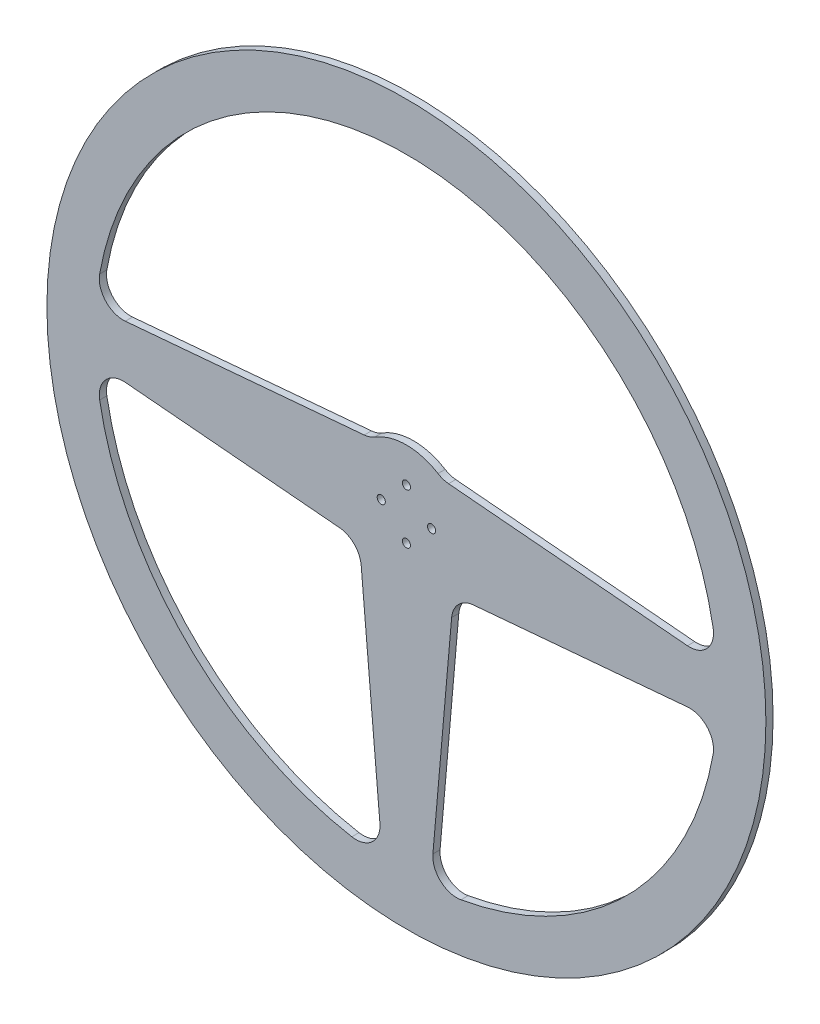
ISO-10303-21;
HEADER;
FILE_DESCRIPTION(('STEP AP214'),'2;1');
FILE_NAME('part.step','',(''),(''),'','','');
FILE_SCHEMA(('AUTOMOTIVE_DESIGN { 1 0 10303 214 1 1 1 1 }'));
ENDSEC;
DATA;
#1=APPLICATION_CONTEXT('core data for automotive mechanical design processes');
#2=APPLICATION_PROTOCOL_DEFINITION('international standard','automotive_design',2000,#1);
#3=PRODUCT_CONTEXT('',#1,'mechanical');
#4=PRODUCT('Part','Part','',(#3));
#5=PRODUCT_RELATED_PRODUCT_CATEGORY('part','',(#4));
#6=PRODUCT_DEFINITION_FORMATION('','',#4);
#7=PRODUCT_DEFINITION_CONTEXT('part definition',#1,'design');
#8=PRODUCT_DEFINITION('design','',#6,#7);
#9=PRODUCT_DEFINITION_SHAPE('','',#8);
#10=(LENGTH_UNIT() NAMED_UNIT(*) SI_UNIT(.MILLI.,.METRE.));
#11=(NAMED_UNIT(*) PLANE_ANGLE_UNIT() SI_UNIT($,.RADIAN.));
#12=(NAMED_UNIT(*) SI_UNIT($,.STERADIAN.) SOLID_ANGLE_UNIT());
#13=UNCERTAINTY_MEASURE_WITH_UNIT(LENGTH_MEASURE(1.E-05),#10,'distance_accuracy_value','');
#14=(GEOMETRIC_REPRESENTATION_CONTEXT(3) GLOBAL_UNCERTAINTY_ASSIGNED_CONTEXT((#13)) GLOBAL_UNIT_ASSIGNED_CONTEXT((#10,
#11,#12)) REPRESENTATION_CONTEXT('',''));
#15=CARTESIAN_POINT('',(0.,0.,0.));
#16=DIRECTION('',(0.,0.,1.));
#17=DIRECTION('',(1.,0.,0.));
#18=AXIS2_PLACEMENT_3D('',#15,#16,#17);
#19=CARTESIAN_POINT('',(0.,0.,3.));
#20=DIRECTION('',(0.,0.,-1.));
#21=DIRECTION('',(-1.,0.,0.));
#22=AXIS2_PLACEMENT_3D('',#19,#20,#21);
#23=CYLINDRICAL_SURFACE('',#22,130.);
#24=CARTESIAN_POINT('',(0.,0.,0.));
#25=DIRECTION('',(0.,0.,1.));
#26=DIRECTION('',(1.,0.,0.));
#27=AXIS2_PLACEMENT_3D('',#24,#25,#26);
#28=CIRCLE('',#27,130.);
#29=CARTESIAN_POINT('',(127.991176755483,22.7652953582125,0.));
#30=VERTEX_POINT('',#29);
#31=CARTESIAN_POINT('',(-127.991176755479,22.7652953582353,0.));
#32=VERTEX_POINT('',#31);
#33=EDGE_CURVE('E204',#30,#32,#28,.T.);
#34=ORIENTED_EDGE('',*,*,#33,.F.);
#35=DIRECTION('',(0.,0.,-1.));
#36=VECTOR('',#35,1.);
#37=CARTESIAN_POINT('',(127.991176755483,22.7652953582125,3.));
#38=LINE('',#37,#36);
#39=CARTESIAN_POINT('',(127.991176755483,22.7652953582125,3.));
#40=VERTEX_POINT('',#39);
#41=EDGE_CURVE('E57',#30,#40,#38,.F.);
#42=ORIENTED_EDGE('',*,*,#41,.T.);
#43=CARTESIAN_POINT('',(0.,0.,3.));
#44=DIRECTION('',(0.,0.,1.));
#45=DIRECTION('',(1.,0.,0.));
#46=AXIS2_PLACEMENT_3D('',#43,#44,#45);
#47=CIRCLE('',#46,130.);
#48=CARTESIAN_POINT('',(-127.991176755479,22.7652953582353,3.));
#49=VERTEX_POINT('',#48);
#50=EDGE_CURVE('E307',#40,#49,#47,.T.);
#51=ORIENTED_EDGE('',*,*,#50,.T.);
#52=DIRECTION('',(0.,0.,-1.));
#53=VECTOR('',#52,1.);
#54=CARTESIAN_POINT('',(-127.991176755479,22.7652953582353,3.));
#55=LINE('',#54,#53);
#56=EDGE_CURVE('E262',#49,#32,#55,.T.);
#57=ORIENTED_EDGE('',*,*,#56,.T.);
#58=EDGE_LOOP('',(#34,#42,#51,#57));
#59=FACE_BOUND('',#58,.T.);
#60=ADVANCED_FACE('F37',(#59),#23,.F.);
#61=CARTESIAN_POINT('',(1.85042362908211,21.1504388626259,3.));
#62=DIRECTION('',(0.0871557427478548,0.996194698091728,0.));
#63=DIRECTION('',(-0.996194698091728,0.0871557427478548,0.));
#64=AXIS2_PLACEMENT_3D('',#61,#62,#63);
#65=PLANE('',#64);
#66=DIRECTION('',(0.996194698091728,-0.0871557427478548,0.));
#67=VECTOR('',#66,1.);
#68=CARTESIAN_POINT('',(1.85042362908211,21.1504388626259,0.));
#69=LINE('',#68,#67);
#70=CARTESIAN_POINT('',(17.5893624701358,19.7734601381027,0.));
#71=VERTEX_POINT('',#70);
#72=CARTESIAN_POINT('',(117.274144192968,11.0521718112789,0.));
#73=VERTEX_POINT('',#72);
#74=EDGE_CURVE('E209',#71,#73,#69,.T.);
#75=ORIENTED_EDGE('',*,*,#74,.F.);
#76=DIRECTION('',(0.,0.,-1.));
#77=VECTOR('',#76,1.);
#78=CARTESIAN_POINT('',(17.5893624701358,19.7734601381027,3.));
#79=LINE('',#78,#77);
#80=CARTESIAN_POINT('',(17.5893624701358,19.7734601381027,3.));
#81=VERTEX_POINT('',#80);
#82=EDGE_CURVE('E245',#71,#81,#79,.F.);
#83=ORIENTED_EDGE('',*,*,#82,.T.);
#84=DIRECTION('',(0.996194698091728,-0.0871557427478548,0.));
#85=VECTOR('',#84,1.);
#86=CARTESIAN_POINT('',(1.85042362908211,21.1504388626259,3.));
#87=LINE('',#86,#85);
#88=CARTESIAN_POINT('',(117.274144192968,11.0521718112789,3.));
#89=VERTEX_POINT('',#88);
#90=EDGE_CURVE('E309',#81,#89,#87,.T.);
#91=ORIENTED_EDGE('',*,*,#90,.T.);
#92=DIRECTION('',(0.,0.,1.));
#93=VECTOR('',#92,1.);
#94=CARTESIAN_POINT('',(117.274144192968,11.0521718112789,0.));
#95=LINE('',#94,#93);
#96=EDGE_CURVE('E242',#89,#73,#95,.F.);
#97=ORIENTED_EDGE('',*,*,#96,.T.);
#98=EDGE_LOOP('',(#75,#83,#91,#97));
#99=FACE_BOUND('',#98,.T.);
#100=ADVANCED_FACE('F425',(#99),#65,.T.);
#101=CARTESIAN_POINT('',(0.,0.,3.));
#102=DIRECTION('',(0.,0.,-1.));
#103=DIRECTION('',(-1.,0.,0.));
#104=AXIS2_PLACEMENT_3D('',#101,#102,#103);
#105=CYLINDRICAL_SURFACE('',#104,25.);
#106=CARTESIAN_POINT('',(0.,0.,3.));
#107=DIRECTION('',(0.,0.,1.));
#108=DIRECTION('',(1.,0.,0.));
#109=AXIS2_PLACEMENT_3D('',#106,#107,#108);
#110=CIRCLE('',#109,25.);
#111=CARTESIAN_POINT('',(13.1863713554388,21.2395765135857,3.));
#112=VERTEX_POINT('',#111);
#113=CARTESIAN_POINT('',(-13.1863713554376,21.2395765135865,3.));
#114=VERTEX_POINT('',#113);
#115=EDGE_CURVE('E314',#112,#114,#110,.T.);
#116=ORIENTED_EDGE('',*,*,#115,.F.);
#117=DIRECTION('',(0.,0.,-1.));
#118=VECTOR('',#117,1.);
#119=CARTESIAN_POINT('',(13.1863713554388,21.2395765135857,3.));
#120=LINE('',#119,#118);
#121=CARTESIAN_POINT('',(13.1863713554388,21.2395765135857,0.));
#122=VERTEX_POINT('',#121);
#123=EDGE_CURVE('E239',#112,#122,#120,.T.);
#124=ORIENTED_EDGE('',*,*,#123,.T.);
#125=CARTESIAN_POINT('',(0.,0.,0.));
#126=DIRECTION('',(0.,0.,1.));
#127=DIRECTION('',(1.,0.,0.));
#128=AXIS2_PLACEMENT_3D('',#125,#126,#127);
#129=CIRCLE('',#128,25.);
#130=CARTESIAN_POINT('',(-13.1863713554376,21.2395765135865,0.));
#131=VERTEX_POINT('',#130);
#132=EDGE_CURVE('E212',#122,#131,#129,.T.);
#133=ORIENTED_EDGE('',*,*,#132,.T.);
#134=DIRECTION('',(0.,0.,-1.));
#135=VECTOR('',#134,1.);
#136=CARTESIAN_POINT('',(-13.1863713554376,21.2395765135865,3.));
#137=LINE('',#136,#135);
#138=EDGE_CURVE('E237',#131,#114,#137,.F.);
#139=ORIENTED_EDGE('',*,*,#138,.T.);
#140=EDGE_LOOP('',(#116,#124,#133,#139));
#141=FACE_BOUND('',#140,.T.);
#142=ADVANCED_FACE('F431',(#141),#105,.T.);
#143=CARTESIAN_POINT('',(21.1504388626266,-1.85042362908007,3.));
#144=DIRECTION('',(0.996194698091737,-0.0871557427477565,0.));
#145=DIRECTION('',(0.0871557427477565,0.996194698091737,0.));
#146=AXIS2_PLACEMENT_3D('',#143,#144,#145);
#147=PLANE('',#146);
#148=DIRECTION('',(-0.0871557427477565,-0.996194698091737,0.));
#149=VECTOR('',#148,1.);
#150=CARTESIAN_POINT('',(21.1504388626266,-1.85042362908007,0.));
#151=LINE('',#150,#149);
#152=CARTESIAN_POINT('',(18.8664255619977,-27.9568151154413,0.));
#153=VERTEX_POINT('',#152);
#154=CARTESIAN_POINT('',(11.052171811291,-117.274144192966,0.));
#155=VERTEX_POINT('',#154);
#156=EDGE_CURVE('E202',#153,#155,#151,.T.);
#157=ORIENTED_EDGE('',*,*,#156,.F.);
#158=DIRECTION('',(0.,0.,-1.));
#159=VECTOR('',#158,1.);
#160=CARTESIAN_POINT('',(18.8664255619977,-27.9568151154413,3.));
#161=LINE('',#160,#159);
#162=CARTESIAN_POINT('',(18.8664255619977,-27.9568151154413,3.));
#163=VERTEX_POINT('',#162);
#164=EDGE_CURVE('E179',#153,#163,#161,.F.);
#165=ORIENTED_EDGE('',*,*,#164,.T.);
#166=DIRECTION('',(-0.0871557427477565,-0.996194698091737,0.));
#167=VECTOR('',#166,1.);
#168=CARTESIAN_POINT('',(21.1504388626266,-1.85042362908007,3.));
#169=LINE('',#168,#167);
#170=CARTESIAN_POINT('',(11.052171811291,-117.274144192966,3.));
#171=VERTEX_POINT('',#170);
#172=EDGE_CURVE('E320',#163,#171,#169,.T.);
#173=ORIENTED_EDGE('',*,*,#172,.T.);
#174=DIRECTION('',(0.,0.,1.));
#175=VECTOR('',#174,1.);
#176=CARTESIAN_POINT('',(11.052171811291,-117.274144192966,0.));
#177=LINE('',#176,#175);
#178=EDGE_CURVE('E194',#171,#155,#177,.F.);
#179=ORIENTED_EDGE('',*,*,#178,.T.);
#180=EDGE_LOOP('',(#157,#165,#173,#179));
#181=FACE_BOUND('',#180,.T.);
#182=ADVANCED_FACE('F449',(#181),#147,.T.);
#183=CARTESIAN_POINT('',(1.85042362907343,-21.1504388626228,3.));
#184=DIRECTION('',(-0.0871557427474617,0.996194698091763,0.));
#185=DIRECTION('',(-0.996194698091763,-0.0871557427474617,0.));
#186=AXIS2_PLACEMENT_3D('',#183,#184,#185);
#187=PLANE('',#186);
#188=DIRECTION('',(0.996194698091763,0.0871557427474617,0.));
#189=VECTOR('',#188,1.);
#190=CARTESIAN_POINT('',(1.85042362907343,-21.1504388626228,3.));
#191=LINE('',#190,#189);
#192=CARTESIAN_POINT('',(27.9568151154405,-18.8664255620012,3.));
#193=VERTEX_POINT('',#192);
#194=CARTESIAN_POINT('',(117.274144192964,-11.0521718113213,3.));
#195=VERTEX_POINT('',#194);
#196=EDGE_CURVE('E193',#193,#195,#191,.T.);
#197=ORIENTED_EDGE('',*,*,#196,.F.);
#198=DIRECTION('',(0.,0.,-1.));
#199=VECTOR('',#198,1.);
#200=CARTESIAN_POINT('',(27.9568151154405,-18.8664255620012,3.));
#201=LINE('',#200,#199);
#202=CARTESIAN_POINT('',(27.9568151154405,-18.8664255620012,0.));
#203=VERTEX_POINT('',#202);
#204=EDGE_CURVE('E178',#193,#203,#201,.T.);
#205=ORIENTED_EDGE('',*,*,#204,.T.);
#206=DIRECTION('',(0.996194698091763,0.0871557427474617,0.));
#207=VECTOR('',#206,1.);
#208=CARTESIAN_POINT('',(1.85042362907343,-21.1504388626228,0.));
#209=LINE('',#208,#207);
#210=CARTESIAN_POINT('',(117.274144192964,-11.0521718113213,0.));
#211=VERTEX_POINT('',#210);
#212=EDGE_CURVE('E190',#203,#211,#209,.T.);
#213=ORIENTED_EDGE('',*,*,#212,.T.);
#214=DIRECTION('',(0.,0.,-1.));
#215=VECTOR('',#214,1.);
#216=CARTESIAN_POINT('',(117.274144192964,-11.0521718113213,3.));
#217=LINE('',#216,#215);
#218=EDGE_CURVE('E195',#211,#195,#217,.F.);
#219=ORIENTED_EDGE('',*,*,#218,.T.);
#220=EDGE_LOOP('',(#197,#205,#213,#219));
#221=FACE_BOUND('',#220,.T.);
#222=ADVANCED_FACE('F189',(#221),#187,.F.);
#223=CARTESIAN_POINT('',(-1.85042362907774,-21.1504388626241,3.));
#224=DIRECTION('',(-0.0871557427476582,-0.996194698091746,0.));
#225=DIRECTION('',(0.996194698091746,-0.0871557427476582,0.));
#226=AXIS2_PLACEMENT_3D('',#223,#224,#225);
#227=PLANE('',#226);
#228=DIRECTION('',(-0.996194698091746,0.0871557427476583,0.));
#229=VECTOR('',#228,1.);
#230=CARTESIAN_POINT('',(-1.85042362907774,-21.1504388626241,0.));
#231=LINE('',#230,#229);
#232=CARTESIAN_POINT('',(-27.9568151154386,-18.8664255619978,0.));
#233=VERTEX_POINT('',#232);
#234=CARTESIAN_POINT('',(-117.274144192966,-11.0521718112998,0.));
#235=VERTEX_POINT('',#234);
#236=EDGE_CURVE('E336',#233,#235,#231,.T.);
#237=ORIENTED_EDGE('',*,*,#236,.F.);
#238=DIRECTION('',(0.,0.,-1.));
#239=VECTOR('',#238,1.);
#240=CARTESIAN_POINT('',(-27.9568151154386,-18.8664255619978,3.));
#241=LINE('',#240,#239);
#242=CARTESIAN_POINT('',(-27.9568151154386,-18.8664255619978,3.));
#243=VERTEX_POINT('',#242);
#244=EDGE_CURVE('E235',#233,#243,#241,.F.);
#245=ORIENTED_EDGE('',*,*,#244,.T.);
#246=DIRECTION('',(-0.996194698091746,0.0871557427476583,0.));
#247=VECTOR('',#246,1.);
#248=CARTESIAN_POINT('',(-1.85042362907774,-21.1504388626241,3.));
#249=LINE('',#248,#247);
#250=CARTESIAN_POINT('',(-117.274144192966,-11.0521718112998,3.));
#251=VERTEX_POINT('',#250);
#252=EDGE_CURVE('E221',#243,#251,#249,.T.);
#253=ORIENTED_EDGE('',*,*,#252,.T.);
#254=DIRECTION('',(0.,0.,1.));
#255=VECTOR('',#254,1.);
#256=CARTESIAN_POINT('',(-117.274144192966,-11.0521718112998,0.));
#257=LINE('',#256,#255);
#258=EDGE_CURVE('E232',#251,#235,#257,.F.);
#259=ORIENTED_EDGE('',*,*,#258,.T.);
#260=EDGE_LOOP('',(#237,#245,#253,#259));
#261=FACE_BOUND('',#260,.T.);
#262=ADVANCED_FACE('F400',(#261),#227,.T.);
#263=CARTESIAN_POINT('',(-21.1504388626216,-1.85042362907543,3.));
#264=DIRECTION('',(0.996194698091754,0.08715574274756,0.));
#265=DIRECTION('',(-0.08715574274756,0.996194698091754,0.));
#266=AXIS2_PLACEMENT_3D('',#263,#264,#265);
#267=PLANE('',#266);
#268=DIRECTION('',(0.08715574274756,-0.996194698091754,0.));
#269=VECTOR('',#268,1.);
#270=CARTESIAN_POINT('',(-21.1504388626216,-1.85042362907543,3.));
#271=LINE('',#270,#269);
#272=CARTESIAN_POINT('',(-18.8664255619977,-27.9568151154396,3.));
#273=VERTEX_POINT('',#272);
#274=CARTESIAN_POINT('',(-11.0521718113087,-117.274144192965,3.));
#275=VERTEX_POINT('',#274);
#276=EDGE_CURVE('E321',#273,#275,#271,.T.);
#277=ORIENTED_EDGE('',*,*,#276,.F.);
#278=DIRECTION('',(0.,0.,-1.));
#279=VECTOR('',#278,1.);
#280=CARTESIAN_POINT('',(-18.8664255619977,-27.9568151154396,3.));
#281=LINE('',#280,#279);
#282=CARTESIAN_POINT('',(-18.8664255619977,-27.9568151154396,0.));
#283=VERTEX_POINT('',#282);
#284=EDGE_CURVE('E229',#273,#283,#281,.T.);
#285=ORIENTED_EDGE('',*,*,#284,.T.);
#286=DIRECTION('',(0.08715574274756,-0.996194698091754,0.));
#287=VECTOR('',#286,1.);
#288=CARTESIAN_POINT('',(-21.1504388626216,-1.85042362907543,0.));
#289=LINE('',#288,#287);
#290=CARTESIAN_POINT('',(-11.0521718113087,-117.274144192965,0.));
#291=VERTEX_POINT('',#290);
#292=EDGE_CURVE('E386',#283,#291,#289,.T.);
#293=ORIENTED_EDGE('',*,*,#292,.T.);
#294=DIRECTION('',(0.,0.,-1.));
#295=VECTOR('',#294,1.);
#296=CARTESIAN_POINT('',(-11.0521718113087,-117.274144192965,3.));
#297=LINE('',#296,#295);
#298=EDGE_CURVE('E227',#291,#275,#297,.F.);
#299=ORIENTED_EDGE('',*,*,#298,.T.);
#300=EDGE_LOOP('',(#277,#285,#293,#299));
#301=FACE_BOUND('',#300,.T.);
#302=ADVANCED_FACE('F406',(#301),#267,.F.);
#303=CARTESIAN_POINT('',(-1.85042362907774,21.1504388626241,3.));
#304=DIRECTION('',(0.0871557427476582,-0.996194698091746,0.));
#305=DIRECTION('',(0.996194698091746,0.0871557427476582,0.));
#306=AXIS2_PLACEMENT_3D('',#303,#304,#305);
#307=PLANE('',#306);
#308=DIRECTION('',(-0.996194698091746,-0.0871557427476583,0.));
#309=VECTOR('',#308,1.);
#310=CARTESIAN_POINT('',(-1.85042362907774,21.1504388626241,3.));
#311=LINE('',#310,#309);
#312=CARTESIAN_POINT('',(-17.5893624701361,19.7734601381036,3.));
#313=VERTEX_POINT('',#312);
#314=CARTESIAN_POINT('',(-117.274144192966,11.0521718112998,3.));
#315=VERTEX_POINT('',#314);
#316=EDGE_CURVE('E379',#313,#315,#311,.T.);
#317=ORIENTED_EDGE('',*,*,#316,.F.);
#318=DIRECTION('',(0.,0.,1.));
#319=VECTOR('',#318,1.);
#320=CARTESIAN_POINT('',(-17.5893624701361,19.7734601381036,0.));
#321=LINE('',#320,#319);
#322=CARTESIAN_POINT('',(-17.5893624701361,19.7734601381036,0.));
#323=VERTEX_POINT('',#322);
#324=EDGE_CURVE('E249',#313,#323,#321,.F.);
#325=ORIENTED_EDGE('',*,*,#324,.T.);
#326=DIRECTION('',(-0.996194698091746,-0.0871557427476583,0.));
#327=VECTOR('',#326,1.);
#328=CARTESIAN_POINT('',(-1.85042362907774,21.1504388626241,0.));
#329=LINE('',#328,#327);
#330=CARTESIAN_POINT('',(-117.274144192966,11.0521718112998,0.));
#331=VERTEX_POINT('',#330);
#332=EDGE_CURVE('E215',#323,#331,#329,.T.);
#333=ORIENTED_EDGE('',*,*,#332,.T.);
#334=DIRECTION('',(0.,0.,-1.));
#335=VECTOR('',#334,1.);
#336=CARTESIAN_POINT('',(-117.274144192966,11.0521718112998,3.));
#337=LINE('',#336,#335);
#338=EDGE_CURVE('E247',#331,#315,#337,.F.);
#339=ORIENTED_EDGE('',*,*,#338,.T.);
#340=EDGE_LOOP('',(#317,#325,#333,#339));
#341=FACE_BOUND('',#340,.T.);
#342=ADVANCED_FACE('F305',(#341),#307,.F.);
#343=CARTESIAN_POINT('',(22.7652953582258,-127.991176755481,0.));
#344=VERTEX_POINT('',#343);
#345=CARTESIAN_POINT('',(127.991176755475,-22.7652953582588,0.));
#346=VERTEX_POINT('',#345);
#347=EDGE_CURVE('E201',#344,#346,#28,.T.);
#348=ORIENTED_EDGE('',*,*,#347,.F.);
#349=DIRECTION('',(0.,0.,-1.));
#350=VECTOR('',#349,1.);
#351=CARTESIAN_POINT('',(22.7652953582258,-127.991176755481,3.));
#352=LINE('',#351,#350);
#353=CARTESIAN_POINT('',(22.7652953582258,-127.991176755481,3.));
#354=VERTEX_POINT('',#353);
#355=EDGE_CURVE('E260',#344,#354,#352,.F.);
#356=ORIENTED_EDGE('',*,*,#355,.T.);
#357=CARTESIAN_POINT('',(127.991176755475,-22.7652953582588,3.));
#358=VERTEX_POINT('',#357);
#359=EDGE_CURVE('E310',#354,#358,#47,.T.);
#360=ORIENTED_EDGE('',*,*,#359,.T.);
#361=DIRECTION('',(0.,0.,-1.));
#362=VECTOR('',#361,1.);
#363=CARTESIAN_POINT('',(127.991176755475,-22.7652953582588,3.));
#364=LINE('',#363,#362);
#365=EDGE_CURVE('E257',#358,#346,#364,.T.);
#366=ORIENTED_EDGE('',*,*,#365,.T.);
#367=EDGE_LOOP('',(#348,#356,#360,#366));
#368=FACE_BOUND('',#367,.T.);
#369=ADVANCED_FACE('F427',(#368),#23,.F.);
#370=CARTESIAN_POINT('',(-127.991176755479,-22.7652953582353,3.));
#371=VERTEX_POINT('',#370);
#372=CARTESIAN_POINT('',(-22.7652953582451,-127.991176755477,3.));
#373=VERTEX_POINT('',#372);
#374=EDGE_CURVE('E312',#371,#373,#47,.T.);
#375=ORIENTED_EDGE('',*,*,#374,.T.);
#376=DIRECTION('',(0.,0.,-1.));
#377=VECTOR('',#376,1.);
#378=CARTESIAN_POINT('',(-22.7652953582451,-127.991176755477,3.));
#379=LINE('',#378,#377);
#380=CARTESIAN_POINT('',(-22.7652953582451,-127.991176755477,0.));
#381=VERTEX_POINT('',#380);
#382=EDGE_CURVE('E254',#373,#381,#379,.T.);
#383=ORIENTED_EDGE('',*,*,#382,.T.);
#384=CARTESIAN_POINT('',(-127.991176755479,-22.7652953582353,0.));
#385=VERTEX_POINT('',#384);
#386=EDGE_CURVE('E206',#385,#381,#28,.T.);
#387=ORIENTED_EDGE('',*,*,#386,.F.);
#388=DIRECTION('',(0.,0.,-1.));
#389=VECTOR('',#388,1.);
#390=CARTESIAN_POINT('',(-127.991176755479,-22.7652953582353,3.));
#391=LINE('',#390,#389);
#392=EDGE_CURVE('E252',#385,#371,#391,.F.);
#393=ORIENTED_EDGE('',*,*,#392,.T.);
#394=EDGE_LOOP('',(#375,#383,#387,#393));
#395=FACE_BOUND('',#394,.T.);
#396=ADVANCED_FACE('F393',(#395),#23,.F.);
#397=CARTESIAN_POINT('',(0.,0.,3.));
#398=DIRECTION('',(0.,0.,-1.));
#399=DIRECTION('',(-1.,0.,0.));
#400=AXIS2_PLACEMENT_3D('',#397,#398,#399);
#401=CYLINDRICAL_SURFACE('',#400,150.);
#402=CARTESIAN_POINT('',(0.,0.,3.));
#403=DIRECTION('',(0.,0.,1.));
#404=DIRECTION('',(1.,0.,0.));
#405=AXIS2_PLACEMENT_3D('',#402,#403,#404);
#406=CIRCLE('',#405,150.);
#407=CARTESIAN_POINT('',(150.,0.,3.));
#408=VERTEX_POINT('',#407);
#409=EDGE_CURVE('E222',#408,#408,#406,.T.);
#410=ORIENTED_EDGE('',*,*,#409,.F.);
#411=EDGE_LOOP('',(#410));
#412=FACE_BOUND('',#411,.T.);
#413=CARTESIAN_POINT('',(0.,0.,0.));
#414=DIRECTION('',(0.,0.,1.));
#415=DIRECTION('',(1.,0.,0.));
#416=AXIS2_PLACEMENT_3D('',#413,#414,#415);
#417=CIRCLE('',#416,150.);
#418=CARTESIAN_POINT('',(150.,0.,0.));
#419=VERTEX_POINT('',#418);
#420=EDGE_CURVE('E218',#419,#419,#417,.T.);
#421=ORIENTED_EDGE('',*,*,#420,.T.);
#422=EDGE_LOOP('',(#421));
#423=FACE_BOUND('',#422,.T.);
#424=ADVANCED_FACE('F364',(#412,#423),#401,.T.);
#425=CARTESIAN_POINT('',(0.,0.,3.));
#426=DIRECTION('',(0.,0.,1.));
#427=DIRECTION('',(1.,0.,0.));
#428=AXIS2_PLACEMENT_3D('',#425,#426,#427);
#429=PLANE('',#428);
#430=CARTESIAN_POINT('',(0.,10.5,3.));
#431=DIRECTION('',(0.,0.,1.));
#432=DIRECTION('',(1.,0.,0.));
#433=AXIS2_PLACEMENT_3D('',#430,#431,#432);
#434=CIRCLE('',#433,1.69999999999999);
#435=CARTESIAN_POINT('',(1.69999999999999,10.5,3.));
#436=VERTEX_POINT('',#435);
#437=EDGE_CURVE('E355',#436,#436,#434,.T.);
#438=ORIENTED_EDGE('',*,*,#437,.F.);
#439=EDGE_LOOP('',(#438));
#440=FACE_BOUND('',#439,.T.);
#441=CARTESIAN_POINT('',(10.5000000000003,2.97142069880137E-13,3.));
#442=DIRECTION('',(0.,0.,1.));
#443=DIRECTION('',(1.,0.,0.));
#444=AXIS2_PLACEMENT_3D('',#441,#442,#443);
#445=CIRCLE('',#444,1.69999999999999);
#446=CARTESIAN_POINT('',(12.2000000000003,2.97142069880137E-13,3.));
#447=VERTEX_POINT('',#446);
#448=EDGE_CURVE('E349',#447,#447,#445,.T.);
#449=ORIENTED_EDGE('',*,*,#448,.F.);
#450=EDGE_LOOP('',(#449));
#451=FACE_BOUND('',#450,.T.);
#452=CARTESIAN_POINT('',(5.94284139760275E-13,-10.5,3.));
#453=DIRECTION('',(0.,0.,1.));
#454=DIRECTION('',(1.,0.,0.));
#455=AXIS2_PLACEMENT_3D('',#452,#453,#454);
#456=CIRCLE('',#455,1.69999999999999);
#457=CARTESIAN_POINT('',(1.70000000000058,-10.5,3.));
#458=VERTEX_POINT('',#457);
#459=EDGE_CURVE('E343',#458,#458,#456,.T.);
#460=ORIENTED_EDGE('',*,*,#459,.F.);
#461=EDGE_LOOP('',(#460));
#462=FACE_BOUND('',#461,.T.);
#463=CARTESIAN_POINT('',(-10.4999999999997,-2.95856190741033E-13,3.));
#464=DIRECTION('',(0.,0.,1.));
#465=DIRECTION('',(1.,0.,0.));
#466=AXIS2_PLACEMENT_3D('',#463,#464,#465);
#467=CIRCLE('',#466,1.69999999999999);
#468=CARTESIAN_POINT('',(-8.79999999999972,-2.95856190741033E-13,3.));
#469=VERTEX_POINT('',#468);
#470=EDGE_CURVE('E337',#469,#469,#467,.T.);
#471=ORIENTED_EDGE('',*,*,#470,.F.);
#472=EDGE_LOOP('',(#471));
#473=FACE_BOUND('',#472,.T.);
#474=ORIENTED_EDGE('',*,*,#252,.F.);
#475=CARTESIAN_POINT('',(-28.8283725429152,-28.8283725429152,3.));
#476=DIRECTION('',(0.,0.,1.));
#477=DIRECTION('',(1.,0.,0.));
#478=AXIS2_PLACEMENT_3D('',#475,#476,#477);
#479=CIRCLE('',#478,10.);
#480=EDGE_CURVE('E269',#243,#273,#479,.F.);
#481=ORIENTED_EDGE('',*,*,#480,.T.);
#482=ORIENTED_EDGE('',*,*,#276,.T.);
#483=CARTESIAN_POINT('',(-21.0141187922262,-118.145701620441,3.));
#484=DIRECTION('',(0.,0.,1.));
#485=DIRECTION('',(1.,0.,0.));
#486=AXIS2_PLACEMENT_3D('',#483,#484,#485);
#487=CIRCLE('',#486,10.);
#488=EDGE_CURVE('E281',#275,#373,#487,.F.);
#489=ORIENTED_EDGE('',*,*,#488,.T.);
#490=ORIENTED_EDGE('',*,*,#374,.F.);
#491=CARTESIAN_POINT('',(-118.145701620442,-21.0141187922172,3.));
#492=DIRECTION('',(0.,0.,1.));
#493=DIRECTION('',(1.,0.,0.));
#494=AXIS2_PLACEMENT_3D('',#491,#492,#493);
#495=CIRCLE('',#494,10.);
#496=EDGE_CURVE('E296',#371,#251,#495,.F.);
#497=ORIENTED_EDGE('',*,*,#496,.T.);
#498=EDGE_LOOP('',(#474,#481,#482,#489,#490,#497));
#499=FACE_BOUND('',#498,.T.);
#500=ORIENTED_EDGE('',*,*,#172,.F.);
#501=CARTESIAN_POINT('',(28.8283725429151,-28.8283725429188,3.));
#502=DIRECTION('',(0.,0.,1.));
#503=DIRECTION('',(1.,0.,0.));
#504=AXIS2_PLACEMENT_3D('',#501,#502,#503);
#505=CIRCLE('',#504,10.);
#506=EDGE_CURVE('E184',#163,#193,#505,.F.);
#507=ORIENTED_EDGE('',*,*,#506,.T.);
#508=ORIENTED_EDGE('',*,*,#196,.T.);
#509=CARTESIAN_POINT('',(118.145701620438,-21.0141187922389,3.));
#510=DIRECTION('',(0.,0.,1.));
#511=DIRECTION('',(1.,0.,0.));
#512=AXIS2_PLACEMENT_3D('',#509,#510,#511);
#513=CIRCLE('',#512,10.);
#514=EDGE_CURVE('E288',#195,#358,#513,.F.);
#515=ORIENTED_EDGE('',*,*,#514,.T.);
#516=ORIENTED_EDGE('',*,*,#359,.F.);
#517=CARTESIAN_POINT('',(21.0141187922084,-118.145701620444,3.));
#518=DIRECTION('',(0.,0.,1.));
#519=DIRECTION('',(1.,0.,0.));
#520=AXIS2_PLACEMENT_3D('',#517,#518,#519);
#521=CIRCLE('',#520,10.);
#522=EDGE_CURVE('E285',#354,#171,#521,.F.);
#523=ORIENTED_EDGE('',*,*,#522,.T.);
#524=EDGE_LOOP('',(#500,#507,#508,#515,#516,#523));
#525=FACE_BOUND('',#524,.T.);
#526=ORIENTED_EDGE('',*,*,#50,.F.);
#527=CARTESIAN_POINT('',(118.145701620446,21.0141187921962,3.));
#528=DIRECTION('',(0.,0.,1.));
#529=DIRECTION('',(1.,0.,0.));
#530=AXIS2_PLACEMENT_3D('',#527,#528,#529);
#531=CIRCLE('',#530,10.);
#532=EDGE_CURVE('E292',#40,#89,#531,.F.);
#533=ORIENTED_EDGE('',*,*,#532,.T.);
#534=ORIENTED_EDGE('',*,*,#90,.F.);
#535=CARTESIAN_POINT('',(18.4609198976144,29.73540711902,3.));
#536=DIRECTION('',(0.,0.,1.));
#537=DIRECTION('',(1.,0.,0.));
#538=AXIS2_PLACEMENT_3D('',#535,#536,#537);
#539=CIRCLE('',#538,10.);
#540=EDGE_CURVE('E273',#81,#112,#539,.F.);
#541=ORIENTED_EDGE('',*,*,#540,.T.);
#542=ORIENTED_EDGE('',*,*,#115,.T.);
#543=CARTESIAN_POINT('',(-18.4609198976127,29.7354071190211,3.));
#544=DIRECTION('',(0.,0.,1.));
#545=DIRECTION('',(1.,0.,0.));
#546=AXIS2_PLACEMENT_3D('',#543,#544,#545);
#547=CIRCLE('',#546,10.);
#548=EDGE_CURVE('E277',#114,#313,#547,.F.);
#549=ORIENTED_EDGE('',*,*,#548,.T.);
#550=ORIENTED_EDGE('',*,*,#316,.T.);
#551=CARTESIAN_POINT('',(-118.145701620442,21.0141187922172,3.));
#552=DIRECTION('',(0.,0.,1.));
#553=DIRECTION('',(1.,0.,0.));
#554=AXIS2_PLACEMENT_3D('',#551,#552,#553);
#555=CIRCLE('',#554,10.);
#556=EDGE_CURVE('E11',#315,#49,#555,.F.);
#557=ORIENTED_EDGE('',*,*,#556,.T.);
#558=EDGE_LOOP('',(#526,#533,#534,#541,#542,#549,#550,#557));
#559=FACE_BOUND('',#558,.T.);
#560=ORIENTED_EDGE('',*,*,#409,.T.);
#561=EDGE_LOOP('',(#560));
#562=FACE_BOUND('',#561,.T.);
#563=ADVANCED_FACE('F361',(#440,#451,#462,#473,#499,#525,#559,#562),#429,.T.);
#564=CARTESIAN_POINT('',(0.,0.,0.));
#565=DIRECTION('',(0.,0.,1.));
#566=DIRECTION('',(1.,0.,0.));
#567=AXIS2_PLACEMENT_3D('',#564,#565,#566);
#568=PLANE('',#567);
#569=CARTESIAN_POINT('',(0.,10.5,0.));
#570=DIRECTION('',(0.,0.,1.));
#571=DIRECTION('',(1.,0.,0.));
#572=AXIS2_PLACEMENT_3D('',#569,#570,#571);
#573=CIRCLE('',#572,1.7);
#574=CARTESIAN_POINT('',(1.7,10.5,0.));
#575=VERTEX_POINT('',#574);
#576=EDGE_CURVE('E352',#575,#575,#573,.T.);
#577=ORIENTED_EDGE('',*,*,#576,.T.);
#578=EDGE_LOOP('',(#577));
#579=FACE_BOUND('',#578,.T.);
#580=CARTESIAN_POINT('',(10.5000000000003,2.97142069880137E-13,0.));
#581=DIRECTION('',(0.,0.,1.));
#582=DIRECTION('',(1.,0.,0.));
#583=AXIS2_PLACEMENT_3D('',#580,#581,#582);
#584=CIRCLE('',#583,1.7);
#585=CARTESIAN_POINT('',(12.2000000000003,2.97142069880137E-13,0.));
#586=VERTEX_POINT('',#585);
#587=EDGE_CURVE('E346',#586,#586,#584,.T.);
#588=ORIENTED_EDGE('',*,*,#587,.T.);
#589=EDGE_LOOP('',(#588));
#590=FACE_BOUND('',#589,.T.);
#591=CARTESIAN_POINT('',(5.94284139760275E-13,-10.5,0.));
#592=DIRECTION('',(0.,0.,1.));
#593=DIRECTION('',(1.,0.,0.));
#594=AXIS2_PLACEMENT_3D('',#591,#592,#593);
#595=CIRCLE('',#594,1.7);
#596=CARTESIAN_POINT('',(1.70000000000059,-10.5,0.));
#597=VERTEX_POINT('',#596);
#598=EDGE_CURVE('E340',#597,#597,#595,.T.);
#599=ORIENTED_EDGE('',*,*,#598,.T.);
#600=EDGE_LOOP('',(#599));
#601=FACE_BOUND('',#600,.T.);
#602=CARTESIAN_POINT('',(-10.4999999999997,-2.95856190741033E-13,0.));
#603=DIRECTION('',(0.,0.,1.));
#604=DIRECTION('',(1.,0.,0.));
#605=AXIS2_PLACEMENT_3D('',#602,#603,#604);
#606=CIRCLE('',#605,1.7);
#607=CARTESIAN_POINT('',(-8.7999999999997,-2.95856190741033E-13,0.));
#608=VERTEX_POINT('',#607);
#609=EDGE_CURVE('E333',#608,#608,#606,.T.);
#610=ORIENTED_EDGE('',*,*,#609,.T.);
#611=EDGE_LOOP('',(#610));
#612=FACE_BOUND('',#611,.T.);
#613=ORIENTED_EDGE('',*,*,#292,.F.);
#614=CARTESIAN_POINT('',(-28.8283725429152,-28.8283725429152,0.));
#615=DIRECTION('',(0.,0.,1.));
#616=DIRECTION('',(1.,0.,0.));
#617=AXIS2_PLACEMENT_3D('',#614,#615,#616);
#618=CIRCLE('',#617,10.);
#619=EDGE_CURVE('E267',#283,#233,#618,.T.);
#620=ORIENTED_EDGE('',*,*,#619,.T.);
#621=ORIENTED_EDGE('',*,*,#236,.T.);
#622=CARTESIAN_POINT('',(-118.145701620442,-21.0141187922172,0.));
#623=DIRECTION('',(0.,0.,1.));
#624=DIRECTION('',(1.,0.,0.));
#625=AXIS2_PLACEMENT_3D('',#622,#623,#624);
#626=CIRCLE('',#625,10.);
#627=EDGE_CURVE('E294',#235,#385,#626,.T.);
#628=ORIENTED_EDGE('',*,*,#627,.T.);
#629=ORIENTED_EDGE('',*,*,#386,.T.);
#630=CARTESIAN_POINT('',(-21.0141187922262,-118.145701620441,0.));
#631=DIRECTION('',(0.,0.,1.));
#632=DIRECTION('',(1.,0.,0.));
#633=AXIS2_PLACEMENT_3D('',#630,#631,#632);
#634=CIRCLE('',#633,10.);
#635=EDGE_CURVE('E279',#381,#291,#634,.T.);
#636=ORIENTED_EDGE('',*,*,#635,.T.);
#637=EDGE_LOOP('',(#613,#620,#621,#628,#629,#636));
#638=FACE_BOUND('',#637,.T.);
#639=ORIENTED_EDGE('',*,*,#212,.F.);
#640=CARTESIAN_POINT('',(28.8283725429151,-28.8283725429188,0.));
#641=DIRECTION('',(0.,0.,1.));
#642=DIRECTION('',(1.,0.,0.));
#643=AXIS2_PLACEMENT_3D('',#640,#641,#642);
#644=CIRCLE('',#643,10.);
#645=EDGE_CURVE('E174',#203,#153,#644,.T.);
#646=ORIENTED_EDGE('',*,*,#645,.T.);
#647=ORIENTED_EDGE('',*,*,#156,.T.);
#648=CARTESIAN_POINT('',(21.0141187922084,-118.145701620444,0.));
#649=DIRECTION('',(0.,0.,1.));
#650=DIRECTION('',(1.,0.,0.));
#651=AXIS2_PLACEMENT_3D('',#648,#649,#650);
#652=CIRCLE('',#651,10.);
#653=EDGE_CURVE('E283',#155,#344,#652,.T.);
#654=ORIENTED_EDGE('',*,*,#653,.T.);
#655=ORIENTED_EDGE('',*,*,#347,.T.);
#656=CARTESIAN_POINT('',(118.145701620438,-21.0141187922389,0.));
#657=DIRECTION('',(0.,0.,1.));
#658=DIRECTION('',(1.,0.,0.));
#659=AXIS2_PLACEMENT_3D('',#656,#657,#658);
#660=CIRCLE('',#659,10.);
#661=EDGE_CURVE('E200',#346,#211,#660,.T.);
#662=ORIENTED_EDGE('',*,*,#661,.T.);
#663=EDGE_LOOP('',(#639,#646,#647,#654,#655,#662));
#664=FACE_BOUND('',#663,.T.);
#665=ORIENTED_EDGE('',*,*,#74,.T.);
#666=CARTESIAN_POINT('',(118.145701620446,21.0141187921962,0.));
#667=DIRECTION('',(0.,0.,1.));
#668=DIRECTION('',(1.,0.,0.));
#669=AXIS2_PLACEMENT_3D('',#666,#667,#668);
#670=CIRCLE('',#669,10.);
#671=EDGE_CURVE('E290',#73,#30,#670,.T.);
#672=ORIENTED_EDGE('',*,*,#671,.T.);
#673=ORIENTED_EDGE('',*,*,#33,.T.);
#674=CARTESIAN_POINT('',(-118.145701620442,21.0141187922172,0.));
#675=DIRECTION('',(0.,0.,1.));
#676=DIRECTION('',(1.,0.,0.));
#677=AXIS2_PLACEMENT_3D('',#674,#675,#676);
#678=CIRCLE('',#677,10.);
#679=EDGE_CURVE('E45',#32,#331,#678,.T.);
#680=ORIENTED_EDGE('',*,*,#679,.T.);
#681=ORIENTED_EDGE('',*,*,#332,.F.);
#682=CARTESIAN_POINT('',(-18.4609198976127,29.7354071190211,0.));
#683=DIRECTION('',(0.,0.,1.));
#684=DIRECTION('',(1.,0.,0.));
#685=AXIS2_PLACEMENT_3D('',#682,#683,#684);
#686=CIRCLE('',#685,10.);
#687=EDGE_CURVE('E275',#323,#131,#686,.T.);
#688=ORIENTED_EDGE('',*,*,#687,.T.);
#689=ORIENTED_EDGE('',*,*,#132,.F.);
#690=CARTESIAN_POINT('',(18.4609198976144,29.73540711902,0.));
#691=DIRECTION('',(0.,0.,1.));
#692=DIRECTION('',(1.,0.,0.));
#693=AXIS2_PLACEMENT_3D('',#690,#691,#692);
#694=CIRCLE('',#693,10.);
#695=EDGE_CURVE('E271',#122,#71,#694,.T.);
#696=ORIENTED_EDGE('',*,*,#695,.T.);
#697=EDGE_LOOP('',(#665,#672,#673,#680,#681,#688,#689,#696));
#698=FACE_BOUND('',#697,.T.);
#699=ORIENTED_EDGE('',*,*,#420,.F.);
#700=EDGE_LOOP('',(#699));
#701=FACE_BOUND('',#700,.T.);
#702=ADVANCED_FACE('F197',(#579,#590,#601,#612,#638,#664,#698,#701),#568,.F.);
#703=CARTESIAN_POINT('',(28.8283725429151,-28.8283725429188,3.));
#704=DIRECTION('',(0.,0.,-1.));
#705=DIRECTION('',(-1.,0.,0.));
#706=AXIS2_PLACEMENT_3D('',#703,#704,#705);
#707=CYLINDRICAL_SURFACE('',#706,10.);
#708=ORIENTED_EDGE('',*,*,#506,.F.);
#709=ORIENTED_EDGE('',*,*,#164,.F.);
#710=ORIENTED_EDGE('',*,*,#645,.F.);
#711=ORIENTED_EDGE('',*,*,#204,.F.);
#712=EDGE_LOOP('',(#708,#709,#710,#711));
#713=FACE_BOUND('',#712,.T.);
#714=ADVANCED_FACE('F177',(#713),#707,.F.);
#715=CARTESIAN_POINT('',(-28.8283725429152,-28.8283725429152,3.));
#716=DIRECTION('',(0.,0.,-1.));
#717=DIRECTION('',(-1.,0.,0.));
#718=AXIS2_PLACEMENT_3D('',#715,#716,#717);
#719=CYLINDRICAL_SURFACE('',#718,10.);
#720=ORIENTED_EDGE('',*,*,#480,.F.);
#721=ORIENTED_EDGE('',*,*,#244,.F.);
#722=ORIENTED_EDGE('',*,*,#619,.F.);
#723=ORIENTED_EDGE('',*,*,#284,.F.);
#724=EDGE_LOOP('',(#720,#721,#722,#723));
#725=FACE_BOUND('',#724,.T.);
#726=ADVANCED_FACE('F403',(#725),#719,.F.);
#727=CARTESIAN_POINT('',(18.4609198976144,29.73540711902,3.));
#728=DIRECTION('',(0.,0.,-1.));
#729=DIRECTION('',(-1.,0.,0.));
#730=AXIS2_PLACEMENT_3D('',#727,#728,#729);
#731=CYLINDRICAL_SURFACE('',#730,10.);
#732=ORIENTED_EDGE('',*,*,#540,.F.);
#733=ORIENTED_EDGE('',*,*,#82,.F.);
#734=ORIENTED_EDGE('',*,*,#695,.F.);
#735=ORIENTED_EDGE('',*,*,#123,.F.);
#736=EDGE_LOOP('',(#732,#733,#734,#735));
#737=FACE_BOUND('',#736,.T.);
#738=ADVANCED_FACE('F421',(#737),#731,.F.);
#739=CARTESIAN_POINT('',(-18.4609198976127,29.7354071190211,3.));
#740=DIRECTION('',(0.,0.,-1.));
#741=DIRECTION('',(-1.,0.,0.));
#742=AXIS2_PLACEMENT_3D('',#739,#740,#741);
#743=CYLINDRICAL_SURFACE('',#742,10.);
#744=ORIENTED_EDGE('',*,*,#548,.F.);
#745=ORIENTED_EDGE('',*,*,#138,.F.);
#746=ORIENTED_EDGE('',*,*,#687,.F.);
#747=ORIENTED_EDGE('',*,*,#324,.F.);
#748=EDGE_LOOP('',(#744,#745,#746,#747));
#749=FACE_BOUND('',#748,.T.);
#750=ADVANCED_FACE('F412',(#749),#743,.F.);
#751=CARTESIAN_POINT('',(-21.0141187922262,-118.145701620441,3.));
#752=DIRECTION('',(0.,0.,-1.));
#753=DIRECTION('',(-1.,0.,0.));
#754=AXIS2_PLACEMENT_3D('',#751,#752,#753);
#755=CYLINDRICAL_SURFACE('',#754,10.);
#756=ORIENTED_EDGE('',*,*,#488,.F.);
#757=ORIENTED_EDGE('',*,*,#298,.F.);
#758=ORIENTED_EDGE('',*,*,#635,.F.);
#759=ORIENTED_EDGE('',*,*,#382,.F.);
#760=EDGE_LOOP('',(#756,#757,#758,#759));
#761=FACE_BOUND('',#760,.T.);
#762=ADVANCED_FACE('F409',(#761),#755,.F.);
#763=CARTESIAN_POINT('',(21.0141187922084,-118.145701620444,3.));
#764=DIRECTION('',(0.,0.,-1.));
#765=DIRECTION('',(-1.,0.,0.));
#766=AXIS2_PLACEMENT_3D('',#763,#764,#765);
#767=CYLINDRICAL_SURFACE('',#766,10.);
#768=ORIENTED_EDGE('',*,*,#522,.F.);
#769=ORIENTED_EDGE('',*,*,#355,.F.);
#770=ORIENTED_EDGE('',*,*,#653,.F.);
#771=ORIENTED_EDGE('',*,*,#178,.F.);
#772=EDGE_LOOP('',(#768,#769,#770,#771));
#773=FACE_BOUND('',#772,.T.);
#774=ADVANCED_FACE('F411',(#773),#767,.F.);
#775=CARTESIAN_POINT('',(118.145701620438,-21.0141187922389,3.));
#776=DIRECTION('',(0.,0.,-1.));
#777=DIRECTION('',(-1.,0.,0.));
#778=AXIS2_PLACEMENT_3D('',#775,#776,#777);
#779=CYLINDRICAL_SURFACE('',#778,10.);
#780=ORIENTED_EDGE('',*,*,#514,.F.);
#781=ORIENTED_EDGE('',*,*,#218,.F.);
#782=ORIENTED_EDGE('',*,*,#661,.F.);
#783=ORIENTED_EDGE('',*,*,#365,.F.);
#784=EDGE_LOOP('',(#780,#781,#782,#783));
#785=FACE_BOUND('',#784,.T.);
#786=ADVANCED_FACE('F418',(#785),#779,.F.);
#787=CARTESIAN_POINT('',(118.145701620446,21.0141187921962,3.));
#788=DIRECTION('',(0.,0.,-1.));
#789=DIRECTION('',(-1.,0.,0.));
#790=AXIS2_PLACEMENT_3D('',#787,#788,#789);
#791=CYLINDRICAL_SURFACE('',#790,10.);
#792=ORIENTED_EDGE('',*,*,#532,.F.);
#793=ORIENTED_EDGE('',*,*,#41,.F.);
#794=ORIENTED_EDGE('',*,*,#671,.F.);
#795=ORIENTED_EDGE('',*,*,#96,.F.);
#796=EDGE_LOOP('',(#792,#793,#794,#795));
#797=FACE_BOUND('',#796,.T.);
#798=ADVANCED_FACE('F484',(#797),#791,.F.);
#799=CARTESIAN_POINT('',(-118.145701620442,-21.0141187922172,3.));
#800=DIRECTION('',(0.,0.,-1.));
#801=DIRECTION('',(-1.,0.,0.));
#802=AXIS2_PLACEMENT_3D('',#799,#800,#801);
#803=CYLINDRICAL_SURFACE('',#802,10.);
#804=ORIENTED_EDGE('',*,*,#496,.F.);
#805=ORIENTED_EDGE('',*,*,#392,.F.);
#806=ORIENTED_EDGE('',*,*,#627,.F.);
#807=ORIENTED_EDGE('',*,*,#258,.F.);
#808=EDGE_LOOP('',(#804,#805,#806,#807));
#809=FACE_BOUND('',#808,.T.);
#810=ADVANCED_FACE('F396',(#809),#803,.F.);
#811=CARTESIAN_POINT('',(-118.145701620442,21.0141187922172,3.));
#812=DIRECTION('',(0.,0.,-1.));
#813=DIRECTION('',(-1.,0.,0.));
#814=AXIS2_PLACEMENT_3D('',#811,#812,#813);
#815=CYLINDRICAL_SURFACE('',#814,10.);
#816=ORIENTED_EDGE('',*,*,#556,.F.);
#817=ORIENTED_EDGE('',*,*,#338,.F.);
#818=ORIENTED_EDGE('',*,*,#679,.F.);
#819=ORIENTED_EDGE('',*,*,#56,.F.);
#820=EDGE_LOOP('',(#816,#817,#818,#819));
#821=FACE_BOUND('',#820,.T.);
#822=ADVANCED_FACE('F39',(#821),#815,.F.);
#823=CARTESIAN_POINT('',(-10.4999999999997,-2.95856190741033E-13,3.));
#824=DIRECTION('',(0.,0.,1.));
#825=DIRECTION('',(1.,0.,0.));
#826=AXIS2_PLACEMENT_3D('',#823,#824,#825);
#827=CYLINDRICAL_SURFACE('',#826,1.69999999999999);
#828=ORIENTED_EDGE('',*,*,#609,.F.);
#829=EDGE_LOOP('',(#828));
#830=FACE_BOUND('',#829,.T.);
#831=ORIENTED_EDGE('',*,*,#470,.T.);
#832=EDGE_LOOP('',(#831));
#833=FACE_BOUND('',#832,.T.);
#834=ADVANCED_FACE('F495',(#830,#833),#827,.F.);
#835=CARTESIAN_POINT('',(5.94284139760275E-13,-10.5,3.));
#836=DIRECTION('',(0.,0.,1.));
#837=DIRECTION('',(1.,0.,0.));
#838=AXIS2_PLACEMENT_3D('',#835,#836,#837);
#839=CYLINDRICAL_SURFACE('',#838,1.69999999999999);
#840=ORIENTED_EDGE('',*,*,#598,.F.);
#841=EDGE_LOOP('',(#840));
#842=FACE_BOUND('',#841,.T.);
#843=ORIENTED_EDGE('',*,*,#459,.T.);
#844=EDGE_LOOP('',(#843));
#845=FACE_BOUND('',#844,.T.);
#846=ADVANCED_FACE('F499',(#842,#845),#839,.F.);
#847=CARTESIAN_POINT('',(10.5000000000003,2.97142069880137E-13,3.));
#848=DIRECTION('',(0.,0.,1.));
#849=DIRECTION('',(1.,0.,0.));
#850=AXIS2_PLACEMENT_3D('',#847,#848,#849);
#851=CYLINDRICAL_SURFACE('',#850,1.69999999999999);
#852=ORIENTED_EDGE('',*,*,#587,.F.);
#853=EDGE_LOOP('',(#852));
#854=FACE_BOUND('',#853,.T.);
#855=ORIENTED_EDGE('',*,*,#448,.T.);
#856=EDGE_LOOP('',(#855));
#857=FACE_BOUND('',#856,.T.);
#858=ADVANCED_FACE('F505',(#854,#857),#851,.F.);
#859=CARTESIAN_POINT('',(0.,10.5,3.));
#860=DIRECTION('',(0.,0.,1.));
#861=DIRECTION('',(1.,0.,0.));
#862=AXIS2_PLACEMENT_3D('',#859,#860,#861);
#863=CYLINDRICAL_SURFACE('',#862,1.69999999999999);
#864=ORIENTED_EDGE('',*,*,#576,.F.);
#865=EDGE_LOOP('',(#864));
#866=FACE_BOUND('',#865,.T.);
#867=ORIENTED_EDGE('',*,*,#437,.T.);
#868=EDGE_LOOP('',(#867));
#869=FACE_BOUND('',#868,.T.);
#870=ADVANCED_FACE('F359',(#866,#869),#863,.F.);
#871=CLOSED_SHELL('',(#60,#100,#142,#182,#222,#262,#302,#342,#369,#396,#424,#563,#702,#714,#726,
#738,#750,#762,#774,#786,#798,#810,#822,#834,#846,#858,#870));
#872=MANIFOLD_SOLID_BREP('B2',#871);
#873=ADVANCED_BREP_SHAPE_REPRESENTATION('',(#18,#872),#14);
#874=SHAPE_DEFINITION_REPRESENTATION(#9,#873);
ENDSEC;
END-ISO-10303-21;
